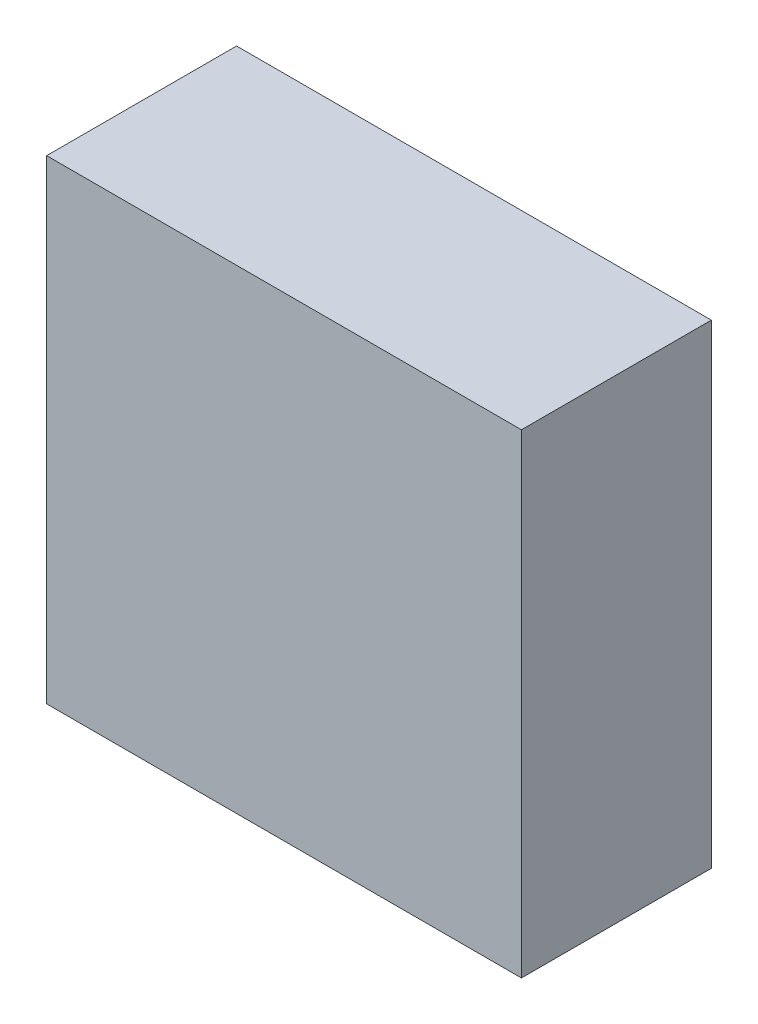
ISO-10303-21;
HEADER;
FILE_DESCRIPTION(('STEP AP214'),'2;1');
FILE_NAME('part.step','',(''),(''),'','','');
FILE_SCHEMA(('AUTOMOTIVE_DESIGN { 1 0 10303 214 1 1 1 1 }'));
ENDSEC;
DATA;
#1=APPLICATION_CONTEXT('core data for automotive mechanical design processes');
#2=APPLICATION_PROTOCOL_DEFINITION('international standard','automotive_design',2000,#1);
#3=PRODUCT_CONTEXT('',#1,'mechanical');
#4=PRODUCT('Part','Part','',(#3));
#5=PRODUCT_RELATED_PRODUCT_CATEGORY('part','',(#4));
#6=PRODUCT_DEFINITION_FORMATION('','',#4);
#7=PRODUCT_DEFINITION_CONTEXT('part definition',#1,'design');
#8=PRODUCT_DEFINITION('design','',#6,#7);
#9=PRODUCT_DEFINITION_SHAPE('','',#8);
#10=(LENGTH_UNIT() NAMED_UNIT(*) SI_UNIT(.MILLI.,.METRE.));
#11=(NAMED_UNIT(*) PLANE_ANGLE_UNIT() SI_UNIT($,.RADIAN.));
#12=(NAMED_UNIT(*) SI_UNIT($,.STERADIAN.) SOLID_ANGLE_UNIT());
#13=UNCERTAINTY_MEASURE_WITH_UNIT(LENGTH_MEASURE(1.E-05),#10,'distance_accuracy_value','');
#14=(GEOMETRIC_REPRESENTATION_CONTEXT(3) GLOBAL_UNCERTAINTY_ASSIGNED_CONTEXT((#13)) GLOBAL_UNIT_ASSIGNED_CONTEXT((#10,
#11,#12)) REPRESENTATION_CONTEXT('',''));
#15=CARTESIAN_POINT('',(0.,0.,0.));
#16=DIRECTION('',(0.,0.,1.));
#17=DIRECTION('',(1.,0.,0.));
#18=AXIS2_PLACEMENT_3D('',#15,#16,#17);
#19=CARTESIAN_POINT('',(0.,0.,6.));
#20=DIRECTION('',(1.,0.,0.));
#21=DIRECTION('',(0.,0.,-1.));
#22=AXIS2_PLACEMENT_3D('',#19,#20,#21);
#23=PLANE('',#22);
#24=DIRECTION('',(0.,-1.,0.));
#25=VECTOR('',#24,1.);
#26=CARTESIAN_POINT('',(0.,0.,0.));
#27=LINE('',#26,#25);
#28=CARTESIAN_POINT('',(0.,15.,0.));
#29=VERTEX_POINT('',#28);
#30=CARTESIAN_POINT('',(0.,0.,0.));
#31=VERTEX_POINT('',#30);
#32=EDGE_CURVE('E97',#29,#31,#27,.T.);
#33=ORIENTED_EDGE('',*,*,#32,.T.);
#34=DIRECTION('',(0.,0.,-1.));
#35=VECTOR('',#34,1.);
#36=CARTESIAN_POINT('',(0.,0.,6.));
#37=LINE('',#36,#35);
#38=CARTESIAN_POINT('',(0.,0.,6.));
#39=VERTEX_POINT('',#38);
#40=EDGE_CURVE('E11',#39,#31,#37,.T.);
#41=ORIENTED_EDGE('',*,*,#40,.F.);
#42=DIRECTION('',(0.,-1.,0.));
#43=VECTOR('',#42,1.);
#44=CARTESIAN_POINT('',(0.,0.,6.));
#45=LINE('',#44,#43);
#46=CARTESIAN_POINT('',(0.,15.,6.));
#47=VERTEX_POINT('',#46);
#48=EDGE_CURVE('E85',#47,#39,#45,.T.);
#49=ORIENTED_EDGE('',*,*,#48,.F.);
#50=DIRECTION('',(0.,0.,-1.));
#51=VECTOR('',#50,1.);
#52=CARTESIAN_POINT('',(0.,15.,6.));
#53=LINE('',#52,#51);
#54=EDGE_CURVE('E93',#47,#29,#53,.T.);
#55=ORIENTED_EDGE('',*,*,#54,.T.);
#56=EDGE_LOOP('',(#33,#41,#49,#55));
#57=FACE_BOUND('',#56,.T.);
#58=ADVANCED_FACE('F34',(#57),#23,.F.);
#59=CARTESIAN_POINT('',(0.,0.,6.));
#60=DIRECTION('',(0.,1.,0.));
#61=DIRECTION('',(0.,0.,1.));
#62=AXIS2_PLACEMENT_3D('',#59,#60,#61);
#63=PLANE('',#62);
#64=DIRECTION('',(1.,0.,0.));
#65=VECTOR('',#64,1.);
#66=CARTESIAN_POINT('',(0.,0.,0.));
#67=LINE('',#66,#65);
#68=CARTESIAN_POINT('',(15.,0.,0.));
#69=VERTEX_POINT('',#68);
#70=EDGE_CURVE('E89',#31,#69,#67,.T.);
#71=ORIENTED_EDGE('',*,*,#70,.T.);
#72=DIRECTION('',(0.,0.,-1.));
#73=VECTOR('',#72,1.);
#74=CARTESIAN_POINT('',(15.,0.,6.));
#75=LINE('',#74,#73);
#76=CARTESIAN_POINT('',(15.,0.,6.));
#77=VERTEX_POINT('',#76);
#78=EDGE_CURVE('E42',#77,#69,#75,.T.);
#79=ORIENTED_EDGE('',*,*,#78,.F.);
#80=DIRECTION('',(1.,0.,0.));
#81=VECTOR('',#80,1.);
#82=CARTESIAN_POINT('',(0.,0.,6.));
#83=LINE('',#82,#81);
#84=EDGE_CURVE('E80',#39,#77,#83,.T.);
#85=ORIENTED_EDGE('',*,*,#84,.F.);
#86=ORIENTED_EDGE('',*,*,#40,.T.);
#87=EDGE_LOOP('',(#71,#79,#85,#86));
#88=FACE_BOUND('',#87,.T.);
#89=ADVANCED_FACE('F88',(#88),#63,.F.);
#90=CARTESIAN_POINT('',(15.,0.,6.));
#91=DIRECTION('',(-1.,0.,0.));
#92=DIRECTION('',(0.,-1.,0.));
#93=AXIS2_PLACEMENT_3D('',#90,#91,#92);
#94=PLANE('',#93);
#95=DIRECTION('',(0.,1.,0.));
#96=VECTOR('',#95,1.);
#97=CARTESIAN_POINT('',(15.,0.,0.));
#98=LINE('',#97,#96);
#99=CARTESIAN_POINT('',(15.,15.,0.));
#100=VERTEX_POINT('',#99);
#101=EDGE_CURVE('E67',#69,#100,#98,.T.);
#102=ORIENTED_EDGE('',*,*,#101,.T.);
#103=DIRECTION('',(0.,0.,-1.));
#104=VECTOR('',#103,1.);
#105=CARTESIAN_POINT('',(15.,15.,6.));
#106=LINE('',#105,#104);
#107=CARTESIAN_POINT('',(15.,15.,6.));
#108=VERTEX_POINT('',#107);
#109=EDGE_CURVE('E90',#108,#100,#106,.T.);
#110=ORIENTED_EDGE('',*,*,#109,.F.);
#111=DIRECTION('',(0.,1.,0.));
#112=VECTOR('',#111,1.);
#113=CARTESIAN_POINT('',(15.,0.,6.));
#114=LINE('',#113,#112);
#115=EDGE_CURVE('E83',#77,#108,#114,.T.);
#116=ORIENTED_EDGE('',*,*,#115,.F.);
#117=ORIENTED_EDGE('',*,*,#78,.T.);
#118=EDGE_LOOP('',(#102,#110,#116,#117));
#119=FACE_BOUND('',#118,.T.);
#120=ADVANCED_FACE('F91',(#119),#94,.F.);
#121=CARTESIAN_POINT('',(0.,15.,6.));
#122=DIRECTION('',(0.,-1.,0.));
#123=DIRECTION('',(0.,0.,-1.));
#124=AXIS2_PLACEMENT_3D('',#121,#122,#123);
#125=PLANE('',#124);
#126=DIRECTION('',(-1.,0.,0.));
#127=VECTOR('',#126,1.);
#128=CARTESIAN_POINT('',(0.,15.,0.));
#129=LINE('',#128,#127);
#130=EDGE_CURVE('E73',#100,#29,#129,.T.);
#131=ORIENTED_EDGE('',*,*,#130,.T.);
#132=ORIENTED_EDGE('',*,*,#54,.F.);
#133=DIRECTION('',(-1.,0.,0.));
#134=VECTOR('',#133,1.);
#135=CARTESIAN_POINT('',(0.,15.,6.));
#136=LINE('',#135,#134);
#137=EDGE_CURVE('E50',#108,#47,#136,.T.);
#138=ORIENTED_EDGE('',*,*,#137,.F.);
#139=ORIENTED_EDGE('',*,*,#109,.T.);
#140=EDGE_LOOP('',(#131,#132,#138,#139));
#141=FACE_BOUND('',#140,.T.);
#142=ADVANCED_FACE('F104',(#141),#125,.F.);
#143=CARTESIAN_POINT('',(0.,0.,6.));
#144=DIRECTION('',(0.,0.,-1.));
#145=DIRECTION('',(-1.,0.,0.));
#146=AXIS2_PLACEMENT_3D('',#143,#144,#145);
#147=PLANE('',#146);
#148=ORIENTED_EDGE('',*,*,#48,.T.);
#149=ORIENTED_EDGE('',*,*,#84,.T.);
#150=ORIENTED_EDGE('',*,*,#115,.T.);
#151=ORIENTED_EDGE('',*,*,#137,.T.);
#152=EDGE_LOOP('',(#148,#149,#150,#151));
#153=FACE_BOUND('',#152,.T.);
#154=ADVANCED_FACE('F81',(#153),#147,.F.);
#155=CARTESIAN_POINT('',(0.,0.,0.));
#156=DIRECTION('',(0.,0.,-1.));
#157=DIRECTION('',(-1.,0.,0.));
#158=AXIS2_PLACEMENT_3D('',#155,#156,#157);
#159=PLANE('',#158);
#160=ORIENTED_EDGE('',*,*,#32,.F.);
#161=ORIENTED_EDGE('',*,*,#130,.F.);
#162=ORIENTED_EDGE('',*,*,#101,.F.);
#163=ORIENTED_EDGE('',*,*,#70,.F.);
#164=EDGE_LOOP('',(#160,#161,#162,#163));
#165=FACE_BOUND('',#164,.T.);
#166=ADVANCED_FACE('F107',(#165),#159,.T.);
#167=CLOSED_SHELL('',(#58,#89,#120,#142,#154,#166));
#168=MANIFOLD_SOLID_BREP('B2',#167);
#169=ADVANCED_BREP_SHAPE_REPRESENTATION('',(#18,#168),#14);
#170=SHAPE_DEFINITION_REPRESENTATION(#9,#169);
ENDSEC;
END-ISO-10303-21;
